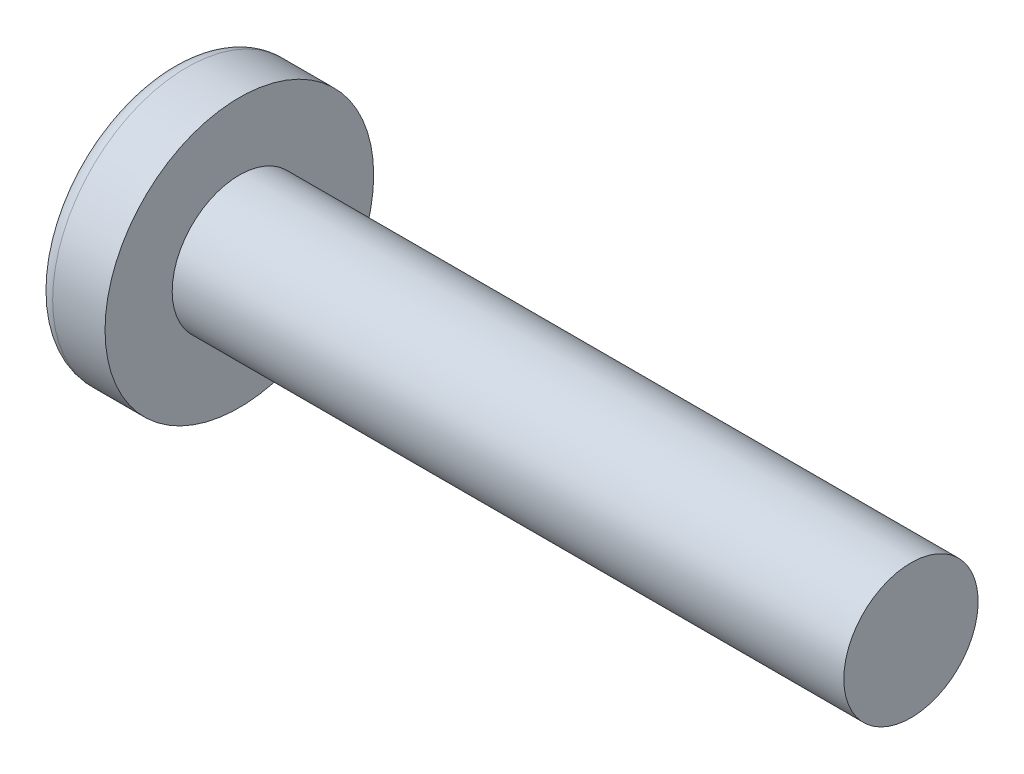
ISO-10303-21;
HEADER;
FILE_DESCRIPTION(('STEP AP214'),'2;1');
FILE_NAME('part.step','',(''),(''),'','','');
FILE_SCHEMA(('AUTOMOTIVE_DESIGN { 1 0 10303 214 1 1 1 1 }'));
ENDSEC;
DATA;
#1=APPLICATION_CONTEXT('core data for automotive mechanical design processes');
#2=APPLICATION_PROTOCOL_DEFINITION('international standard','automotive_design',2000,#1);
#3=PRODUCT_CONTEXT('',#1,'mechanical');
#4=PRODUCT('Part','Part','',(#3));
#5=PRODUCT_RELATED_PRODUCT_CATEGORY('part','',(#4));
#6=PRODUCT_DEFINITION_FORMATION('','',#4);
#7=PRODUCT_DEFINITION_CONTEXT('part definition',#1,'design');
#8=PRODUCT_DEFINITION('design','',#6,#7);
#9=PRODUCT_DEFINITION_SHAPE('','',#8);
#10=(LENGTH_UNIT() NAMED_UNIT(*) SI_UNIT(.MILLI.,.METRE.));
#11=(NAMED_UNIT(*) PLANE_ANGLE_UNIT() SI_UNIT($,.RADIAN.));
#12=(NAMED_UNIT(*) SI_UNIT($,.STERADIAN.) SOLID_ANGLE_UNIT());
#13=UNCERTAINTY_MEASURE_WITH_UNIT(LENGTH_MEASURE(1.E-05),#10,'distance_accuracy_value','');
#14=(GEOMETRIC_REPRESENTATION_CONTEXT(3) GLOBAL_UNCERTAINTY_ASSIGNED_CONTEXT((#13)) GLOBAL_UNIT_ASSIGNED_CONTEXT((#10,
#11,#12)) REPRESENTATION_CONTEXT('',''));
#15=CARTESIAN_POINT('',(0.,0.,0.));
#16=DIRECTION('',(0.,0.,1.));
#17=DIRECTION('',(1.,0.,0.));
#18=AXIS2_PLACEMENT_3D('',#15,#16,#17);
#19=CARTESIAN_POINT('',(1.19,0.12,-0.12));
#20=DIRECTION('',(-1.,0.,0.));
#21=DIRECTION('',(0.,0.,1.));
#22=AXIS2_PLACEMENT_3D('',#19,#20,#21);
#23=PLANE('',#22);
#24=DIRECTION('',(0.,1.,0.));
#25=VECTOR('',#24,1.);
#26=CARTESIAN_POINT('',(1.19,-0.240000000000003,0.119999999999999));
#27=LINE('',#26,#25);
#28=CARTESIAN_POINT('',(1.19,-0.12,0.119999999999999));
#29=VERTEX_POINT('',#28);
#30=CARTESIAN_POINT('',(1.19,0.12,0.12));
#31=VERTEX_POINT('',#30);
#32=EDGE_CURVE('E91',#29,#31,#27,.T.);
#33=ORIENTED_EDGE('',*,*,#32,.T.);
#34=DIRECTION('',(0.,0.,1.));
#35=VECTOR('',#34,1.);
#36=CARTESIAN_POINT('',(1.19,0.12,0.24));
#37=LINE('',#36,#35);
#38=CARTESIAN_POINT('',(1.19,0.12,-0.12));
#39=VERTEX_POINT('',#38);
#40=EDGE_CURVE('E107',#31,#39,#37,.F.);
#41=ORIENTED_EDGE('',*,*,#40,.T.);
#42=DIRECTION('',(0.,1.,0.));
#43=VECTOR('',#42,1.);
#44=CARTESIAN_POINT('',(1.19,0.240000000000003,-0.119999999999999));
#45=LINE('',#44,#43);
#46=CARTESIAN_POINT('',(1.19,-0.12,-0.12));
#47=VERTEX_POINT('',#46);
#48=EDGE_CURVE('E100',#39,#47,#45,.F.);
#49=ORIENTED_EDGE('',*,*,#48,.T.);
#50=DIRECTION('',(0.,0.,1.));
#51=VECTOR('',#50,1.);
#52=CARTESIAN_POINT('',(1.19,-0.12,-0.24));
#53=LINE('',#52,#51);
#54=EDGE_CURVE('E106',#47,#29,#53,.T.);
#55=ORIENTED_EDGE('',*,*,#54,.T.);
#56=EDGE_LOOP('',(#33,#41,#49,#55));
#57=FACE_BOUND('',#56,.T.);
#58=ADVANCED_FACE('F17',(#57),#23,.T.);
#59=CARTESIAN_POINT('',(1.37075949367089,0.,-0.101772151898734));
#60=DIRECTION('',(-0.100331502261418,0.,0.994954064092392));
#61=DIRECTION('',(0.994954064092392,0.,0.100331502261418));
#62=AXIS2_PLACEMENT_3D('',#59,#60,#61);
#63=PLANE('',#62);
#64=DIRECTION('',(0.989983749746913,0.0998302940921252,0.0998302940921257));
#65=VECTOR('',#64,1.);
#66=CARTESIAN_POINT('',(0.0177814447975938,-0.238206913129653,-0.238206913129654));
#67=LINE('',#66,#65);
#68=CARTESIAN_POINT('',(0.0177814447975936,-0.238206913129653,-0.238206913129654));
#69=VERTEX_POINT('',#68);
#70=EDGE_CURVE('E76',#69,#47,#67,.T.);
#71=ORIENTED_EDGE('',*,*,#70,.F.);
#72=CARTESIAN_POINT('',(0.118330716626355,-0.83144431417242,-0.228067490760368));
#73=CARTESIAN_POINT('',(0.0922989105011273,-0.734159201691065,-0.230692546840223));
#74=CARTESIAN_POINT('',(0.0709039014527832,-0.63608019536349,-0.232850026744257));
#75=CARTESIAN_POINT('',(0.0373874775098628,-0.438334395015904,-0.236229834200686));
#76=CARTESIAN_POINT('',(0.0252660626152866,-0.338667600995891,-0.237452161753081));
#77=CARTESIAN_POINT('',(0.0177814447975943,-0.23820691312966,-0.238206913129655));
#78=B_SPLINE_CURVE_WITH_KNOTS('',3,(#72,#73,#74,#75,#76,#77),.UNSPECIFIED.,.F.,.F.,(4,2,4),(0.,
0.301225884553892,0.602451769107783),.UNSPECIFIED.);
#79=CARTESIAN_POINT('',(0.118330716626355,-0.83144431417242,-0.228067490760368));
#80=VERTEX_POINT('',#79);
#81=EDGE_CURVE('E20',#80,#69,#78,.T.);
#82=ORIENTED_EDGE('',*,*,#81,.F.);
#83=DIRECTION('',(0.830201128729582,0.551141925795269,0.083717760880294));
#84=VECTOR('',#83,1.);
#85=CARTESIAN_POINT('',(0.118330716626355,-0.83144431417242,-0.228067490760368));
#86=LINE('',#85,#84);
#87=EDGE_CURVE('E113',#80,#47,#86,.T.);
#88=ORIENTED_EDGE('',*,*,#87,.T.);
#89=EDGE_LOOP('',(#71,#82,#88));
#90=FACE_BOUND('',#89,.T.);
#91=ADVANCED_FACE('F115',(#90),#63,.T.);
#92=CARTESIAN_POINT('',(1.37075949367089,-0.101772151898734,0.));
#93=DIRECTION('',(-0.100331502261417,0.994954064092392,0.));
#94=DIRECTION('',(-0.994954064092392,-0.100331502261417,0.));
#95=AXIS2_PLACEMENT_3D('',#92,#93,#94);
#96=PLANE('',#95);
#97=ORIENTED_EDGE('',*,*,#70,.T.);
#98=DIRECTION('',(-0.830201128729582,-0.0837177608802914,-0.551141925795269));
#99=VECTOR('',#98,1.);
#100=CARTESIAN_POINT('',(1.19,-0.12,-0.12));
#101=LINE('',#100,#99);
#102=CARTESIAN_POINT('',(0.118330716626356,-0.228067490760364,-0.83144431417242));
#103=VERTEX_POINT('',#102);
#104=EDGE_CURVE('E109',#47,#103,#101,.T.);
#105=ORIENTED_EDGE('',*,*,#104,.T.);
#106=CARTESIAN_POINT('',(0.0177814447975934,-0.238206913129653,-0.238206913129654));
#107=CARTESIAN_POINT('',(0.0252660626152852,-0.237452161753077,-0.338667600995884));
#108=CARTESIAN_POINT('',(0.037387477509861,-0.236229834200682,-0.438334395015894));
#109=CARTESIAN_POINT('',(0.0709039014527805,-0.232850026744257,-0.636080195363477));
#110=CARTESIAN_POINT('',(0.0922989105011242,-0.230692546840226,-0.734159201691049));
#111=CARTESIAN_POINT('',(0.118330716626352,-0.228067490760376,-0.831444314172402));
#112=B_SPLINE_CURVE_WITH_KNOTS('',3,(#106,#107,#108,#109,#110,#111),.UNSPECIFIED.,.F.,.F.,(4,2,
4),(0.,0.301225884553885,0.602451769107771),.UNSPECIFIED.);
#113=EDGE_CURVE('E122',#69,#103,#112,.T.);
#114=ORIENTED_EDGE('',*,*,#113,.F.);
#115=EDGE_LOOP('',(#97,#105,#114));
#116=FACE_BOUND('',#115,.T.);
#117=ADVANCED_FACE('F119',(#116),#96,.T.);
#118=CARTESIAN_POINT('',(0.,0.240000000000003,-0.909999999999999));
#119=DIRECTION('',(0.553083521918191,0.,-0.833125811497021));
#120=DIRECTION('',(-0.833125811497021,0.,-0.553083521918191));
#121=AXIS2_PLACEMENT_3D('',#118,#119,#120);
#122=PLANE('',#121);
#123=ORIENTED_EDGE('',*,*,#48,.F.);
#124=DIRECTION('',(0.830201128729582,-0.0837177608802959,0.551141925795269));
#125=VECTOR('',#124,1.);
#126=CARTESIAN_POINT('',(0.118330716626356,0.22806749076037,-0.831444314172419));
#127=LINE('',#126,#125);
#128=CARTESIAN_POINT('',(0.118330716626356,0.22806749076037,-0.831444314172419));
#129=VERTEX_POINT('',#128);
#130=EDGE_CURVE('E127',#129,#39,#127,.T.);
#131=ORIENTED_EDGE('',*,*,#130,.F.);
#132=CARTESIAN_POINT('',(0.118330716626356,-0.228067490760364,-0.83144431417242));
#133=CARTESIAN_POINT('',(0.113565868042631,-0.152044993840242,-0.834607532980103));
#134=CARTESIAN_POINT('',(0.111183443750769,-0.0760224969201193,-0.836189142383944));
#135=CARTESIAN_POINT('',(0.111183443750769,0.0760224969201255,-0.836189142383943));
#136=CARTESIAN_POINT('',(0.113565868042632,0.152044993840248,-0.834607532980102));
#137=CARTESIAN_POINT('',(0.118330716626356,0.22806749076037,-0.831444314172419));
#138=B_SPLINE_CURVE_WITH_KNOTS('',3,(#132,#133,#134,#135,#136,#137),.UNSPECIFIED.,.F.,.F.,(4,2,
4),(0.,0.228228782685369,0.456457565370737),.UNSPECIFIED.);
#139=EDGE_CURVE('E126',#103,#129,#138,.T.);
#140=ORIENTED_EDGE('',*,*,#139,.F.);
#141=ORIENTED_EDGE('',*,*,#104,.F.);
#142=EDGE_LOOP('',(#123,#131,#140,#141));
#143=FACE_BOUND('',#142,.T.);
#144=ADVANCED_FACE('F124',(#143),#122,.F.);
#145=CARTESIAN_POINT('',(1.37075949367089,0.101772151898734,0.));
#146=DIRECTION('',(-0.100331502261418,-0.994954064092392,0.));
#147=DIRECTION('',(0.994954064092392,-0.100331502261418,0.));
#148=AXIS2_PLACEMENT_3D('',#145,#146,#147);
#149=PLANE('',#148);
#150=ORIENTED_EDGE('',*,*,#130,.T.);
#151=DIRECTION('',(0.989983749746913,-0.0998302940921261,0.0998302940921258));
#152=VECTOR('',#151,1.);
#153=CARTESIAN_POINT('',(0.0177814447975947,0.238206913129655,-0.238206913129654));
#154=LINE('',#153,#152);
#155=CARTESIAN_POINT('',(0.0177814447975945,0.238206913129655,-0.238206913129654));
#156=VERTEX_POINT('',#155);
#157=EDGE_CURVE('E129',#156,#39,#154,.T.);
#158=ORIENTED_EDGE('',*,*,#157,.F.);
#159=CARTESIAN_POINT('',(0.118330716626356,0.22806749076037,-0.831444314172419));
#160=CARTESIAN_POINT('',(0.0922989105011281,0.230692546840223,-0.734159201691066));
#161=CARTESIAN_POINT('',(0.0709039014527842,0.232850026744257,-0.636080195363493));
#162=CARTESIAN_POINT('',(0.0373874775098644,0.236229834200689,-0.438334395015911));
#163=CARTESIAN_POINT('',(0.0252660626152886,0.237452161753087,-0.3386676009959));
#164=CARTESIAN_POINT('',(0.0177814447975969,0.238206913129666,-0.238206913129671));
#165=B_SPLINE_CURVE_WITH_KNOTS('',3,(#159,#160,#161,#162,#163,#164),.UNSPECIFIED.,.F.,.F.,(4,2,
4),(0.,0.301225884553886,0.602451769107771),.UNSPECIFIED.);
#166=EDGE_CURVE('E236',#129,#156,#165,.T.);
#167=ORIENTED_EDGE('',*,*,#166,.F.);
#168=EDGE_LOOP('',(#150,#158,#167));
#169=FACE_BOUND('',#168,.T.);
#170=ADVANCED_FACE('F260',(#169),#149,.T.);
#171=CARTESIAN_POINT('',(1.37075949367089,0.,-0.101772151898734));
#172=DIRECTION('',(-0.100331502261418,0.,0.994954064092392));
#173=DIRECTION('',(0.994954064092392,0.,0.100331502261418));
#174=AXIS2_PLACEMENT_3D('',#171,#172,#173);
#175=PLANE('',#174);
#176=ORIENTED_EDGE('',*,*,#157,.T.);
#177=DIRECTION('',(-0.830201128729582,0.551141925795269,-0.0837177608802944));
#178=VECTOR('',#177,1.);
#179=CARTESIAN_POINT('',(1.19,0.12,-0.12));
#180=LINE('',#179,#178);
#181=CARTESIAN_POINT('',(0.118330716626357,0.831444314172419,-0.228067490760368));
#182=VERTEX_POINT('',#181);
#183=EDGE_CURVE('E146',#39,#182,#180,.T.);
#184=ORIENTED_EDGE('',*,*,#183,.T.);
#185=CARTESIAN_POINT('',(0.0177814447975943,0.238206913129656,-0.238206913129654));
#186=CARTESIAN_POINT('',(0.0252660626152866,0.338667600995888,-0.237452161753077));
#187=CARTESIAN_POINT('',(0.0373874775098632,0.438334395015901,-0.236229834200683));
#188=CARTESIAN_POINT('',(0.0709039014527847,0.636080195363488,-0.23285002674426));
#189=CARTESIAN_POINT('',(0.0922989105011296,0.734159201691063,-0.230692546840231));
#190=CARTESIAN_POINT('',(0.118330716626359,0.831444314172419,-0.228067490760384));
#191=B_SPLINE_CURVE_WITH_KNOTS('',3,(#185,#186,#187,#188,#189,#190),.UNSPECIFIED.,.F.,.F.,(4,2,
4),(0.,0.301225884553893,0.602451769107787),.UNSPECIFIED.);
#192=EDGE_CURVE('E222',#156,#182,#191,.T.);
#193=ORIENTED_EDGE('',*,*,#192,.F.);
#194=EDGE_LOOP('',(#176,#184,#193));
#195=FACE_BOUND('',#194,.T.);
#196=ADVANCED_FACE('F220',(#195),#175,.T.);
#197=CARTESIAN_POINT('',(0.,0.91,0.24));
#198=DIRECTION('',(0.553083521918191,0.833125811497021,0.));
#199=DIRECTION('',(-0.833125811497021,0.553083521918191,0.));
#200=AXIS2_PLACEMENT_3D('',#197,#198,#199);
#201=PLANE('',#200);
#202=ORIENTED_EDGE('',*,*,#40,.F.);
#203=DIRECTION('',(0.830201128729582,-0.551141925795269,-0.0837177608802939));
#204=VECTOR('',#203,1.);
#205=CARTESIAN_POINT('',(0.118330716626357,0.831444314172419,0.228067490760367));
#206=LINE('',#205,#204);
#207=CARTESIAN_POINT('',(0.118330716626357,0.831444314172419,0.228067490760367));
#208=VERTEX_POINT('',#207);
#209=EDGE_CURVE('E204',#208,#31,#206,.T.);
#210=ORIENTED_EDGE('',*,*,#209,.F.);
#211=CARTESIAN_POINT('',(0.118330716626357,0.831444314172419,-0.228067490760368));
#212=CARTESIAN_POINT('',(0.113565868042635,0.834607532980067,-0.152044993840246));
#213=CARTESIAN_POINT('',(0.111183443750779,0.836189142383904,-0.0760224969201231));
#214=CARTESIAN_POINT('',(0.111183443750802,0.836189142383956,0.0760224969201228));
#215=CARTESIAN_POINT('',(0.11356586804268,0.83460753298017,0.152044993840246));
#216=CARTESIAN_POINT('',(0.118330716626426,0.831444314172573,0.22806749076037));
#217=B_SPLINE_CURVE_WITH_KNOTS('',3,(#211,#212,#213,#214,#215,#216),.UNSPECIFIED.,.F.,.F.,(4,2,
4),(0.,0.228228782685368,0.456457565370737),.UNSPECIFIED.);
#218=EDGE_CURVE('E229',#182,#208,#217,.T.);
#219=ORIENTED_EDGE('',*,*,#218,.F.);
#220=ORIENTED_EDGE('',*,*,#183,.F.);
#221=EDGE_LOOP('',(#202,#210,#219,#220));
#222=FACE_BOUND('',#221,.T.);
#223=ADVANCED_FACE('F227',(#222),#201,.F.);
#224=CARTESIAN_POINT('',(1.37075949367089,0.,0.101772151898734));
#225=DIRECTION('',(-0.100331502261417,0.,-0.994954064092392));
#226=DIRECTION('',(-0.994954064092392,0.,0.100331502261417));
#227=AXIS2_PLACEMENT_3D('',#224,#225,#226);
#228=PLANE('',#227);
#229=DIRECTION('',(0.989983749746914,-0.0998302940921254,-0.0998302940921255));
#230=VECTOR('',#229,1.);
#231=CARTESIAN_POINT('',(0.0177814447975942,0.238206913129654,0.238206913129654));
#232=LINE('',#231,#230);
#233=CARTESIAN_POINT('',(0.0177814447975938,0.238206913129653,0.238206913129654));
#234=VERTEX_POINT('',#233);
#235=EDGE_CURVE('E142',#234,#31,#232,.T.);
#236=ORIENTED_EDGE('',*,*,#235,.F.);
#237=CARTESIAN_POINT('',(0.118330716626357,0.831444314172419,0.228067490760367));
#238=CARTESIAN_POINT('',(0.0922989105011284,0.734159201691064,0.230692546840222));
#239=CARTESIAN_POINT('',(0.070903901452784,0.63608019536349,0.232850026744256));
#240=CARTESIAN_POINT('',(0.0373874775098633,0.438334395015904,0.236229834200686));
#241=CARTESIAN_POINT('',(0.0252660626152872,0.338667600995892,0.237452161753081));
#242=CARTESIAN_POINT('',(0.0177814447975952,0.23820691312966,0.238206913129656));
#243=B_SPLINE_CURVE_WITH_KNOTS('',3,(#237,#238,#239,#240,#241,#242),.UNSPECIFIED.,.F.,.F.,(4,2,
4),(0.,0.301225884553891,0.602451769107782),.UNSPECIFIED.);
#244=EDGE_CURVE('E232',#208,#234,#243,.T.);
#245=ORIENTED_EDGE('',*,*,#244,.F.);
#246=ORIENTED_EDGE('',*,*,#209,.T.);
#247=EDGE_LOOP('',(#236,#245,#246));
#248=FACE_BOUND('',#247,.T.);
#249=ADVANCED_FACE('F254',(#248),#228,.T.);
#250=CARTESIAN_POINT('',(1.37075949367089,0.101772151898734,0.));
#251=DIRECTION('',(-0.100331502261418,-0.994954064092392,0.));
#252=DIRECTION('',(0.994954064092392,-0.100331502261418,0.));
#253=AXIS2_PLACEMENT_3D('',#250,#251,#252);
#254=PLANE('',#253);
#255=ORIENTED_EDGE('',*,*,#235,.T.);
#256=DIRECTION('',(-0.830201128729582,0.0837177608802918,0.551141925795269));
#257=VECTOR('',#256,1.);
#258=CARTESIAN_POINT('',(1.19,0.12,0.12));
#259=LINE('',#258,#257);
#260=CARTESIAN_POINT('',(0.118330716626356,0.228067490760365,0.831444314172419));
#261=VERTEX_POINT('',#260);
#262=EDGE_CURVE('E141',#31,#261,#259,.T.);
#263=ORIENTED_EDGE('',*,*,#262,.T.);
#264=CARTESIAN_POINT('',(0.0177814447975934,0.238206913129653,0.238206913129653));
#265=CARTESIAN_POINT('',(0.0252660626152851,0.237452161753077,0.338667600995883));
#266=CARTESIAN_POINT('',(0.0373874775098608,0.236229834200683,0.438334395015893));
#267=CARTESIAN_POINT('',(0.0709039014527802,0.232850026744257,0.636080195363476));
#268=CARTESIAN_POINT('',(0.092298910501124,0.230692546840226,0.734159201691048));
#269=CARTESIAN_POINT('',(0.118330716626352,0.228067490760377,0.831444314172402));
#270=B_SPLINE_CURVE_WITH_KNOTS('',3,(#264,#265,#266,#267,#268,#269),.UNSPECIFIED.,.F.,.F.,(4,2,
4),(0.,0.301225884553886,0.602451769107771),.UNSPECIFIED.);
#271=EDGE_CURVE('E234',#234,#261,#270,.T.);
#272=ORIENTED_EDGE('',*,*,#271,.F.);
#273=EDGE_LOOP('',(#255,#263,#272));
#274=FACE_BOUND('',#273,.T.);
#275=ADVANCED_FACE('F338',(#274),#254,.T.);
#276=CARTESIAN_POINT('',(0.,-0.240000000000003,0.909999999999999));
#277=DIRECTION('',(0.553083521918191,0.,0.833125811497021));
#278=DIRECTION('',(0.833125811497021,0.,-0.553083521918191));
#279=AXIS2_PLACEMENT_3D('',#276,#277,#278);
#280=PLANE('',#279);
#281=ORIENTED_EDGE('',*,*,#32,.F.);
#282=DIRECTION('',(0.830201128729582,0.0837177608802958,-0.551141925795268));
#283=VECTOR('',#282,1.);
#284=CARTESIAN_POINT('',(0.118330716626355,-0.22806749076037,0.831444314172419));
#285=LINE('',#284,#283);
#286=CARTESIAN_POINT('',(0.118330716626356,-0.22806749076037,0.831444314172418));
#287=VERTEX_POINT('',#286);
#288=EDGE_CURVE('E193',#287,#29,#285,.T.);
#289=ORIENTED_EDGE('',*,*,#288,.F.);
#290=CARTESIAN_POINT('',(0.118330716626356,0.228067490760365,0.831444314172419));
#291=CARTESIAN_POINT('',(0.113565868042631,0.152044993840242,0.834607532980102));
#292=CARTESIAN_POINT('',(0.111183443750769,0.0760224969201198,0.836189142383943));
#293=CARTESIAN_POINT('',(0.111183443750769,-0.076022496920125,0.836189142383943));
#294=CARTESIAN_POINT('',(0.113565868042632,-0.152044993840247,0.834607532980102));
#295=CARTESIAN_POINT('',(0.118330716626357,-0.22806749076037,0.83144431417242));
#296=B_SPLINE_CURVE_WITH_KNOTS('',3,(#290,#291,#292,#293,#294,#295),.UNSPECIFIED.,.F.,.F.,(4,2,
4),(0.,0.228228782685369,0.456457565370737),.UNSPECIFIED.);
#297=EDGE_CURVE('E319',#261,#287,#296,.T.);
#298=ORIENTED_EDGE('',*,*,#297,.F.);
#299=ORIENTED_EDGE('',*,*,#262,.F.);
#300=EDGE_LOOP('',(#281,#289,#298,#299));
#301=FACE_BOUND('',#300,.T.);
#302=ADVANCED_FACE('F333',(#301),#280,.F.);
#303=CARTESIAN_POINT('',(1.37075949367089,-0.101772151898734,0.));
#304=DIRECTION('',(-0.100331502261417,0.994954064092392,0.));
#305=DIRECTION('',(-0.994954064092392,-0.100331502261417,0.));
#306=AXIS2_PLACEMENT_3D('',#303,#304,#305);
#307=PLANE('',#306);
#308=ORIENTED_EDGE('',*,*,#288,.T.);
#309=DIRECTION('',(0.989983749746914,0.0998302940921259,-0.0998302940921255));
#310=VECTOR('',#309,1.);
#311=CARTESIAN_POINT('',(0.0177814447975943,-0.238206913129655,0.238206913129654));
#312=LINE('',#311,#310);
#313=CARTESIAN_POINT('',(0.0177814447975939,-0.238206913129655,0.238206913129655));
#314=VERTEX_POINT('',#313);
#315=EDGE_CURVE('E116',#314,#29,#312,.T.);
#316=ORIENTED_EDGE('',*,*,#315,.F.);
#317=CARTESIAN_POINT('',(0.118330716626356,-0.22806749076037,0.831444314172418));
#318=CARTESIAN_POINT('',(0.0922989105011273,-0.230692546840223,0.734159201691065));
#319=CARTESIAN_POINT('',(0.070903901452783,-0.232850026744257,0.636080195363493));
#320=CARTESIAN_POINT('',(0.0373874775098632,-0.236229834200689,0.43833439501591));
#321=CARTESIAN_POINT('',(0.0252660626152878,-0.237452161753087,0.3386676009959));
#322=CARTESIAN_POINT('',(0.0177814447975969,-0.238206913129666,0.23820691312967));
#323=B_SPLINE_CURVE_WITH_KNOTS('',3,(#317,#318,#319,#320,#321,#322),.UNSPECIFIED.,.F.,.F.,(4,2,
4),(0.,0.301225884553886,0.602451769107771),.UNSPECIFIED.);
#324=EDGE_CURVE('E318',#287,#314,#323,.T.);
#325=ORIENTED_EDGE('',*,*,#324,.F.);
#326=EDGE_LOOP('',(#308,#316,#325));
#327=FACE_BOUND('',#326,.T.);
#328=ADVANCED_FACE('F329',(#327),#307,.T.);
#329=CARTESIAN_POINT('',(1.37075949367089,0.,0.101772151898734));
#330=DIRECTION('',(-0.100331502261417,0.,-0.994954064092392));
#331=DIRECTION('',(-0.994954064092392,0.,0.100331502261417));
#332=AXIS2_PLACEMENT_3D('',#329,#330,#331);
#333=PLANE('',#332);
#334=ORIENTED_EDGE('',*,*,#315,.T.);
#335=DIRECTION('',(-0.830201128729582,-0.551141925795269,0.083717760880294));
#336=VECTOR('',#335,1.);
#337=CARTESIAN_POINT('',(1.19,-0.12,0.12));
#338=LINE('',#337,#336);
#339=CARTESIAN_POINT('',(0.118330716626355,-0.83144431417242,0.228067490760367));
#340=VERTEX_POINT('',#339);
#341=EDGE_CURVE('E39',#29,#340,#338,.T.);
#342=ORIENTED_EDGE('',*,*,#341,.T.);
#343=CARTESIAN_POINT('',(0.0177814447975935,-0.238206913129655,0.238206913129655));
#344=CARTESIAN_POINT('',(0.0252660626152855,-0.338667600995887,0.237452161753078));
#345=CARTESIAN_POINT('',(0.0373874775098618,-0.4383343950159,0.236229834200683));
#346=CARTESIAN_POINT('',(0.070903901452783,-0.636080195363488,0.232850026744259));
#347=CARTESIAN_POINT('',(0.0922989105011278,-0.734159201691063,0.23069254684023));
#348=CARTESIAN_POINT('',(0.118330716626357,-0.831444314172419,0.228067490760384));
#349=B_SPLINE_CURVE_WITH_KNOTS('',3,(#343,#344,#345,#346,#347,#348),.UNSPECIFIED.,.F.,.F.,(4,2,
4),(0.,0.301225884553894,0.602451769107787),.UNSPECIFIED.);
#350=EDGE_CURVE('E165',#314,#340,#349,.T.);
#351=ORIENTED_EDGE('',*,*,#350,.F.);
#352=EDGE_LOOP('',(#334,#342,#351));
#353=FACE_BOUND('',#352,.T.);
#354=ADVANCED_FACE('F332',(#353),#333,.T.);
#355=CARTESIAN_POINT('',(0.,-0.91,-0.24));
#356=DIRECTION('',(0.553083521918191,-0.833125811497021,0.));
#357=DIRECTION('',(0.833125811497021,0.553083521918191,0.));
#358=AXIS2_PLACEMENT_3D('',#355,#356,#357);
#359=PLANE('',#358);
#360=ORIENTED_EDGE('',*,*,#54,.F.);
#361=ORIENTED_EDGE('',*,*,#87,.F.);
#362=CARTESIAN_POINT('',(0.118330716626355,-0.83144431417242,0.228067490760367));
#363=CARTESIAN_POINT('',(0.113565868042678,-0.834607532980167,0.152044993840247));
#364=CARTESIAN_POINT('',(0.111183443750845,-0.836189142384053,0.0760224969201269));
#365=CARTESIAN_POINT('',(0.111183443750868,-0.836189142384105,-0.076022496920119));
#366=CARTESIAN_POINT('',(0.113565868042724,-0.83460753298027,-0.152044993840245));
#367=CARTESIAN_POINT('',(0.118330716626424,-0.831444314172574,-0.22806749076037));
#368=B_SPLINE_CURVE_WITH_KNOTS('',3,(#362,#363,#364,#365,#366,#367),.UNSPECIFIED.,.F.,.F.,(4,2,
4),(0.,0.228228782685362,0.456457565370739),.UNSPECIFIED.);
#369=EDGE_CURVE('E83',#340,#80,#368,.T.);
#370=ORIENTED_EDGE('',*,*,#369,.F.);
#371=ORIENTED_EDGE('',*,*,#341,.F.);
#372=EDGE_LOOP('',(#360,#361,#370,#371));
#373=FACE_BOUND('',#372,.T.);
#374=ADVANCED_FACE('F112',(#373),#359,.F.);
#375=CARTESIAN_POINT('',(3.2,0.,0.));
#376=DIRECTION('',(0.,1.,0.));
#377=DIRECTION('',(1.,0.,0.));
#378=AXIS2_PLACEMENT_3D('',#375,#376,#377);
#379=SPHERICAL_SURFACE('',#378,3.2);
#380=CARTESIAN_POINT('',(0.627117875780583,0.,0.));
#381=DIRECTION('',(-1.,0.,0.));
#382=DIRECTION('',(0.,0.,1.));
#383=AXIS2_PLACEMENT_3D('',#380,#381,#382);
#384=CIRCLE('',#383,1.9027027027027);
#385=CARTESIAN_POINT('',(0.627117875780583,0.,1.9027027027027));
#386=VERTEX_POINT('',#385);
#387=EDGE_CURVE('E157',#386,#386,#384,.F.);
#388=ORIENTED_EDGE('',*,*,#387,.F.);
#389=EDGE_LOOP('',(#388));
#390=FACE_BOUND('',#389,.T.);
#391=ORIENTED_EDGE('',*,*,#350,.T.);
#392=ORIENTED_EDGE('',*,*,#369,.T.);
#393=ORIENTED_EDGE('',*,*,#81,.T.);
#394=ORIENTED_EDGE('',*,*,#113,.T.);
#395=ORIENTED_EDGE('',*,*,#139,.T.);
#396=ORIENTED_EDGE('',*,*,#166,.T.);
#397=ORIENTED_EDGE('',*,*,#192,.T.);
#398=ORIENTED_EDGE('',*,*,#218,.T.);
#399=ORIENTED_EDGE('',*,*,#244,.T.);
#400=ORIENTED_EDGE('',*,*,#271,.T.);
#401=ORIENTED_EDGE('',*,*,#297,.T.);
#402=ORIENTED_EDGE('',*,*,#324,.T.);
#403=EDGE_LOOP('',(#391,#392,#393,#394,#395,#396,#397,#398,#399,#400,#401,#402));
#404=FACE_BOUND('',#403,.T.);
#405=ADVANCED_FACE('F172',(#390,#404),#379,.T.);
#406=CARTESIAN_POINT('',(0.820084035097039,0.,0.));
#407=DIRECTION('',(-1.,0.,0.));
#408=DIRECTION('',(0.,0.,1.));
#409=AXIS2_PLACEMENT_3D('',#406,#407,#408);
#410=TOROIDAL_SURFACE('',#409,1.76,0.24);
#411=ORIENTED_EDGE('',*,*,#387,.T.);
#412=EDGE_LOOP('',(#411));
#413=FACE_BOUND('',#412,.T.);
#414=CARTESIAN_POINT('',(0.820084035097039,0.,0.));
#415=DIRECTION('',(-1.,0.,0.));
#416=DIRECTION('',(0.,0.,1.));
#417=AXIS2_PLACEMENT_3D('',#414,#415,#416);
#418=CIRCLE('',#417,2.);
#419=CARTESIAN_POINT('',(0.820084035097039,0.,2.));
#420=VERTEX_POINT('',#419);
#421=EDGE_CURVE('E156',#420,#420,#418,.F.);
#422=ORIENTED_EDGE('',*,*,#421,.F.);
#423=EDGE_LOOP('',(#422));
#424=FACE_BOUND('',#423,.T.);
#425=ADVANCED_FACE('F177',(#413,#424),#410,.T.);
#426=CARTESIAN_POINT('',(-25.4,0.,0.));
#427=DIRECTION('',(-1.,0.,0.));
#428=DIRECTION('',(0.,0.,1.));
#429=AXIS2_PLACEMENT_3D('',#426,#427,#428);
#430=CYLINDRICAL_SURFACE('',#429,2.);
#431=ORIENTED_EDGE('',*,*,#421,.T.);
#432=EDGE_LOOP('',(#431));
#433=FACE_BOUND('',#432,.T.);
#434=CARTESIAN_POINT('',(1.6,0.,0.));
#435=DIRECTION('',(-1.,0.,0.));
#436=DIRECTION('',(0.,0.,1.));
#437=AXIS2_PLACEMENT_3D('',#434,#435,#436);
#438=CIRCLE('',#437,2.);
#439=CARTESIAN_POINT('',(1.6,0.,2.));
#440=VERTEX_POINT('',#439);
#441=EDGE_CURVE('E153',#440,#440,#438,.T.);
#442=ORIENTED_EDGE('',*,*,#441,.T.);
#443=EDGE_LOOP('',(#442));
#444=FACE_BOUND('',#443,.T.);
#445=ADVANCED_FACE('F298',(#433,#444),#430,.T.);
#446=CARTESIAN_POINT('',(11.6,1.,0.));
#447=DIRECTION('',(1.,0.,0.));
#448=DIRECTION('',(0.,0.,-1.));
#449=AXIS2_PLACEMENT_3D('',#446,#447,#448);
#450=PLANE('',#449);
#451=CARTESIAN_POINT('',(11.6,0.,0.));
#452=DIRECTION('',(-1.,0.,0.));
#453=DIRECTION('',(0.,0.,1.));
#454=AXIS2_PLACEMENT_3D('',#451,#452,#453);
#455=CIRCLE('',#454,1.);
#456=CARTESIAN_POINT('',(11.6,0.,1.));
#457=VERTEX_POINT('',#456);
#458=EDGE_CURVE('E30',#457,#457,#455,.T.);
#459=ORIENTED_EDGE('',*,*,#458,.F.);
#460=EDGE_LOOP('',(#459));
#461=FACE_BOUND('',#460,.T.);
#462=ADVANCED_FACE('F292',(#461),#450,.T.);
#463=CARTESIAN_POINT('',(1.6,1.,0.));
#464=DIRECTION('',(-1.,0.,0.));
#465=DIRECTION('',(0.,0.,1.));
#466=AXIS2_PLACEMENT_3D('',#463,#464,#465);
#467=PLANE('',#466);
#468=CARTESIAN_POINT('',(1.6,0.,0.));
#469=DIRECTION('',(-1.,0.,0.));
#470=DIRECTION('',(0.,0.,1.));
#471=AXIS2_PLACEMENT_3D('',#468,#469,#470);
#472=CIRCLE('',#471,1.);
#473=CARTESIAN_POINT('',(1.6,0.,1.));
#474=VERTEX_POINT('',#473);
#475=EDGE_CURVE('E10',#474,#474,#472,.F.);
#476=ORIENTED_EDGE('',*,*,#475,.F.);
#477=EDGE_LOOP('',(#476));
#478=FACE_BOUND('',#477,.T.);
#479=ORIENTED_EDGE('',*,*,#441,.F.);
#480=EDGE_LOOP('',(#479));
#481=FACE_BOUND('',#480,.T.);
#482=ADVANCED_FACE('F286',(#478,#481),#467,.F.);
#483=CARTESIAN_POINT('',(-25.4,0.,0.));
#484=DIRECTION('',(-1.,0.,0.));
#485=DIRECTION('',(0.,0.,1.));
#486=AXIS2_PLACEMENT_3D('',#483,#484,#485);
#487=CYLINDRICAL_SURFACE('',#486,1.);
#488=ORIENTED_EDGE('',*,*,#475,.T.);
#489=EDGE_LOOP('',(#488));
#490=FACE_BOUND('',#489,.T.);
#491=ORIENTED_EDGE('',*,*,#458,.T.);
#492=EDGE_LOOP('',(#491));
#493=FACE_BOUND('',#492,.T.);
#494=ADVANCED_FACE('F284',(#490,#493),#487,.T.);
#495=CLOSED_SHELL('',(#58,#91,#117,#144,#170,#196,#223,#249,#275,#302,#328,#354,#374,#405,#425,
#445,#462,#482,#494));
#496=MANIFOLD_SOLID_BREP('B1',#495);
#497=ADVANCED_BREP_SHAPE_REPRESENTATION('',(#18,#496),#14);
#498=SHAPE_DEFINITION_REPRESENTATION(#9,#497);
ENDSEC;
END-ISO-10303-21;
